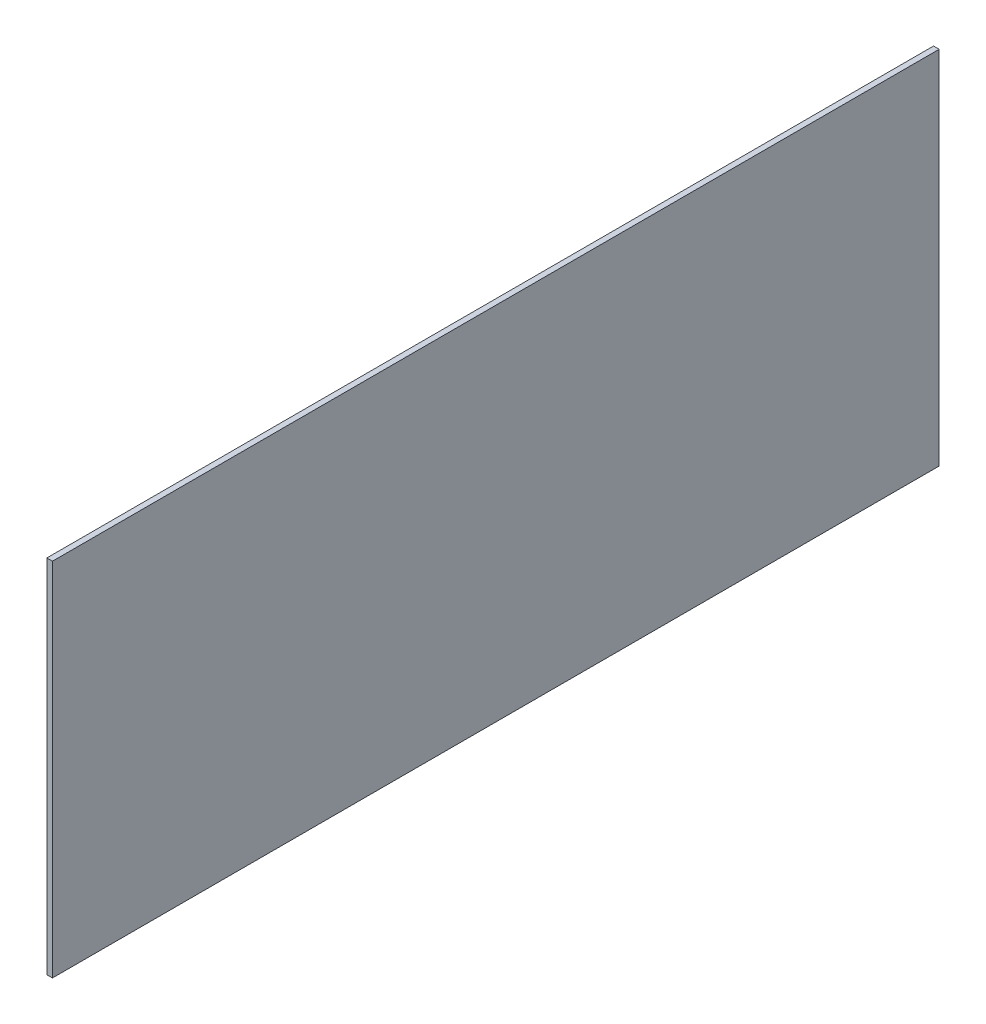
ISO-10303-21;
HEADER;
FILE_DESCRIPTION(('STEP AP214'),'2;1');
FILE_NAME('part.step','',(''),(''),'','','');
FILE_SCHEMA(('AUTOMOTIVE_DESIGN { 1 0 10303 214 1 1 1 1 }'));
ENDSEC;
DATA;
#1=APPLICATION_CONTEXT('core data for automotive mechanical design processes');
#2=APPLICATION_PROTOCOL_DEFINITION('international standard','automotive_design',2000,#1);
#3=PRODUCT_CONTEXT('',#1,'mechanical');
#4=PRODUCT('Part','Part','',(#3));
#5=PRODUCT_RELATED_PRODUCT_CATEGORY('part','',(#4));
#6=PRODUCT_DEFINITION_FORMATION('','',#4);
#7=PRODUCT_DEFINITION_CONTEXT('part definition',#1,'design');
#8=PRODUCT_DEFINITION('design','',#6,#7);
#9=PRODUCT_DEFINITION_SHAPE('','',#8);
#10=(LENGTH_UNIT() NAMED_UNIT(*) SI_UNIT(.MILLI.,.METRE.));
#11=(NAMED_UNIT(*) PLANE_ANGLE_UNIT() SI_UNIT($,.RADIAN.));
#12=(NAMED_UNIT(*) SI_UNIT($,.STERADIAN.) SOLID_ANGLE_UNIT());
#13=UNCERTAINTY_MEASURE_WITH_UNIT(LENGTH_MEASURE(1.E-05),#10,'distance_accuracy_value','');
#14=(GEOMETRIC_REPRESENTATION_CONTEXT(3) GLOBAL_UNCERTAINTY_ASSIGNED_CONTEXT((#13)) GLOBAL_UNIT_ASSIGNED_CONTEXT((#10,
#11,#12)) REPRESENTATION_CONTEXT('',''));
#15=CARTESIAN_POINT('',(0.,0.,0.));
#16=DIRECTION('',(0.,0.,1.));
#17=DIRECTION('',(1.,0.,0.));
#18=AXIS2_PLACEMENT_3D('',#15,#16,#17);
#19=CARTESIAN_POINT('',(1.50000000000043,-10.9317274973586,189.));
#20=DIRECTION('',(0.,0.,1.));
#21=DIRECTION('',(0.,1.,0.));
#22=AXIS2_PLACEMENT_3D('',#19,#20,#21);
#23=PLANE('',#22);
#24=DIRECTION('',(0.,1.,0.));
#25=VECTOR('',#24,1.);
#26=CARTESIAN_POINT('',(1.50000000000043,-10.9317274973586,189.));
#27=LINE('',#26,#25);
#28=CARTESIAN_POINT('',(1.50000000000043,-10.9317274973586,189.));
#29=VERTEX_POINT('',#28);
#30=CARTESIAN_POINT('',(1.5,66.,189.));
#31=VERTEX_POINT('',#30);
#32=EDGE_CURVE('E119',#29,#31,#27,.T.);
#33=ORIENTED_EDGE('',*,*,#32,.T.);
#34=DIRECTION('',(1.,0.,0.));
#35=VECTOR('',#34,1.);
#36=CARTESIAN_POINT('',(1.5,66.,189.));
#37=LINE('',#36,#35);
#38=CARTESIAN_POINT('',(0.3,66.,189.));
#39=VERTEX_POINT('',#38);
#40=EDGE_CURVE('E113',#39,#31,#37,.T.);
#41=ORIENTED_EDGE('',*,*,#40,.F.);
#42=DIRECTION('',(0.,-1.,0.));
#43=VECTOR('',#42,1.);
#44=CARTESIAN_POINT('',(0.300000000000435,-10.9317274973587,189.));
#45=LINE('',#44,#43);
#46=CARTESIAN_POINT('',(0.300000000000435,-10.9317274973587,189.));
#47=VERTEX_POINT('',#46);
#48=EDGE_CURVE('E80',#47,#39,#45,.F.);
#49=ORIENTED_EDGE('',*,*,#48,.F.);
#50=DIRECTION('',(1.,0.,0.));
#51=VECTOR('',#50,1.);
#52=CARTESIAN_POINT('',(1.50000000000043,-10.9317274973586,189.));
#53=LINE('',#52,#51);
#54=EDGE_CURVE('E12',#47,#29,#53,.T.);
#55=ORIENTED_EDGE('',*,*,#54,.T.);
#56=EDGE_LOOP('',(#33,#41,#49,#55));
#57=FACE_BOUND('',#56,.T.);
#58=ADVANCED_FACE('F45',(#57),#23,.T.);
#59=CARTESIAN_POINT('',(1.50000000000043,-10.9317274973586,189.));
#60=DIRECTION('',(0.,1.,0.));
#61=DIRECTION('',(0.,0.,-1.));
#62=AXIS2_PLACEMENT_3D('',#59,#60,#61);
#63=PLANE('',#62);
#64=ORIENTED_EDGE('',*,*,#54,.F.);
#65=DIRECTION('',(0.,0.,1.));
#66=VECTOR('',#65,1.);
#67=CARTESIAN_POINT('',(0.300000000000435,-10.9317274973587,189.));
#68=LINE('',#67,#66);
#69=CARTESIAN_POINT('',(0.300000000000435,-10.9317274973587,0.));
#70=VERTEX_POINT('',#69);
#71=EDGE_CURVE('E120',#47,#70,#68,.F.);
#72=ORIENTED_EDGE('',*,*,#71,.T.);
#73=DIRECTION('',(1.,0.,0.));
#74=VECTOR('',#73,1.);
#75=CARTESIAN_POINT('',(1.50000000000043,-10.9317274973586,0.));
#76=LINE('',#75,#74);
#77=CARTESIAN_POINT('',(1.50000000000043,-10.9317274973586,0.));
#78=VERTEX_POINT('',#77);
#79=EDGE_CURVE('E55',#70,#78,#76,.T.);
#80=ORIENTED_EDGE('',*,*,#79,.T.);
#81=DIRECTION('',(0.,0.,-1.));
#82=VECTOR('',#81,1.);
#83=CARTESIAN_POINT('',(1.50000000000043,-10.9317274973586,189.));
#84=LINE('',#83,#82);
#85=EDGE_CURVE('E123',#29,#78,#84,.T.);
#86=ORIENTED_EDGE('',*,*,#85,.F.);
#87=EDGE_LOOP('',(#64,#72,#80,#86));
#88=FACE_BOUND('',#87,.T.);
#89=ADVANCED_FACE('F140',(#88),#63,.F.);
#90=CARTESIAN_POINT('',(1.50000000000043,-10.9317274973586,0.));
#91=DIRECTION('',(0.,0.,1.));
#92=DIRECTION('',(0.,1.,0.));
#93=AXIS2_PLACEMENT_3D('',#90,#91,#92);
#94=PLANE('',#93);
#95=ORIENTED_EDGE('',*,*,#79,.F.);
#96=DIRECTION('',(0.,-1.,0.));
#97=VECTOR('',#96,1.);
#98=CARTESIAN_POINT('',(0.300000000000435,-10.9317274973587,0.));
#99=LINE('',#98,#97);
#100=CARTESIAN_POINT('',(0.3,66.,0.));
#101=VERTEX_POINT('',#100);
#102=EDGE_CURVE('E89',#70,#101,#99,.F.);
#103=ORIENTED_EDGE('',*,*,#102,.T.);
#104=DIRECTION('',(1.,0.,0.));
#105=VECTOR('',#104,1.);
#106=CARTESIAN_POINT('',(1.5,66.,0.));
#107=LINE('',#106,#105);
#108=CARTESIAN_POINT('',(1.5,66.,0.));
#109=VERTEX_POINT('',#108);
#110=EDGE_CURVE('E92',#101,#109,#107,.T.);
#111=ORIENTED_EDGE('',*,*,#110,.T.);
#112=DIRECTION('',(0.,1.,0.));
#113=VECTOR('',#112,1.);
#114=CARTESIAN_POINT('',(1.50000000000043,-10.9317274973586,0.));
#115=LINE('',#114,#113);
#116=EDGE_CURVE('E116',#78,#109,#115,.T.);
#117=ORIENTED_EDGE('',*,*,#116,.F.);
#118=EDGE_LOOP('',(#95,#103,#111,#117));
#119=FACE_BOUND('',#118,.T.);
#120=ADVANCED_FACE('F91',(#119),#94,.F.);
#121=CARTESIAN_POINT('',(1.5,0.,189.));
#122=DIRECTION('',(-1.,0.,0.));
#123=DIRECTION('',(0.,0.,1.));
#124=AXIS2_PLACEMENT_3D('',#121,#122,#123);
#125=PLANE('',#124);
#126=ORIENTED_EDGE('',*,*,#116,.T.);
#127=DIRECTION('',(0.,0.,-1.));
#128=VECTOR('',#127,1.);
#129=CARTESIAN_POINT('',(1.5,66.,189.));
#130=LINE('',#129,#128);
#131=EDGE_CURVE('E102',#31,#109,#130,.T.);
#132=ORIENTED_EDGE('',*,*,#131,.F.);
#133=ORIENTED_EDGE('',*,*,#32,.F.);
#134=ORIENTED_EDGE('',*,*,#85,.T.);
#135=EDGE_LOOP('',(#126,#132,#133,#134));
#136=FACE_BOUND('',#135,.T.);
#137=ADVANCED_FACE('F47',(#136),#125,.F.);
#138=CARTESIAN_POINT('',(0.300000000000435,-10.9317274973587,189.));
#139=DIRECTION('',(-1.,0.,0.));
#140=DIRECTION('',(0.,-1.,0.));
#141=AXIS2_PLACEMENT_3D('',#138,#139,#140);
#142=PLANE('',#141);
#143=ORIENTED_EDGE('',*,*,#102,.F.);
#144=ORIENTED_EDGE('',*,*,#71,.F.);
#145=ORIENTED_EDGE('',*,*,#48,.T.);
#146=DIRECTION('',(0.,0.,1.));
#147=VECTOR('',#146,1.);
#148=CARTESIAN_POINT('',(0.3,66.,189.));
#149=LINE('',#148,#147);
#150=EDGE_CURVE('E95',#39,#101,#149,.F.);
#151=ORIENTED_EDGE('',*,*,#150,.T.);
#152=EDGE_LOOP('',(#143,#144,#145,#151));
#153=FACE_BOUND('',#152,.T.);
#154=ADVANCED_FACE('F105',(#153),#142,.T.);
#155=CARTESIAN_POINT('',(1.5,66.,189.));
#156=DIRECTION('',(0.,1.,0.));
#157=DIRECTION('',(0.,0.,-1.));
#158=AXIS2_PLACEMENT_3D('',#155,#156,#157);
#159=PLANE('',#158);
#160=ORIENTED_EDGE('',*,*,#110,.F.);
#161=ORIENTED_EDGE('',*,*,#150,.F.);
#162=ORIENTED_EDGE('',*,*,#40,.T.);
#163=ORIENTED_EDGE('',*,*,#131,.T.);
#164=EDGE_LOOP('',(#160,#161,#162,#163));
#165=FACE_BOUND('',#164,.T.);
#166=ADVANCED_FACE('F99',(#165),#159,.T.);
#167=CLOSED_SHELL('',(#58,#89,#120,#137,#154,#166));
#168=MANIFOLD_SOLID_BREP('B2',#167);
#169=ADVANCED_BREP_SHAPE_REPRESENTATION('',(#18,#168),#14);
#170=SHAPE_DEFINITION_REPRESENTATION(#9,#169);
ENDSEC;
END-ISO-10303-21;
